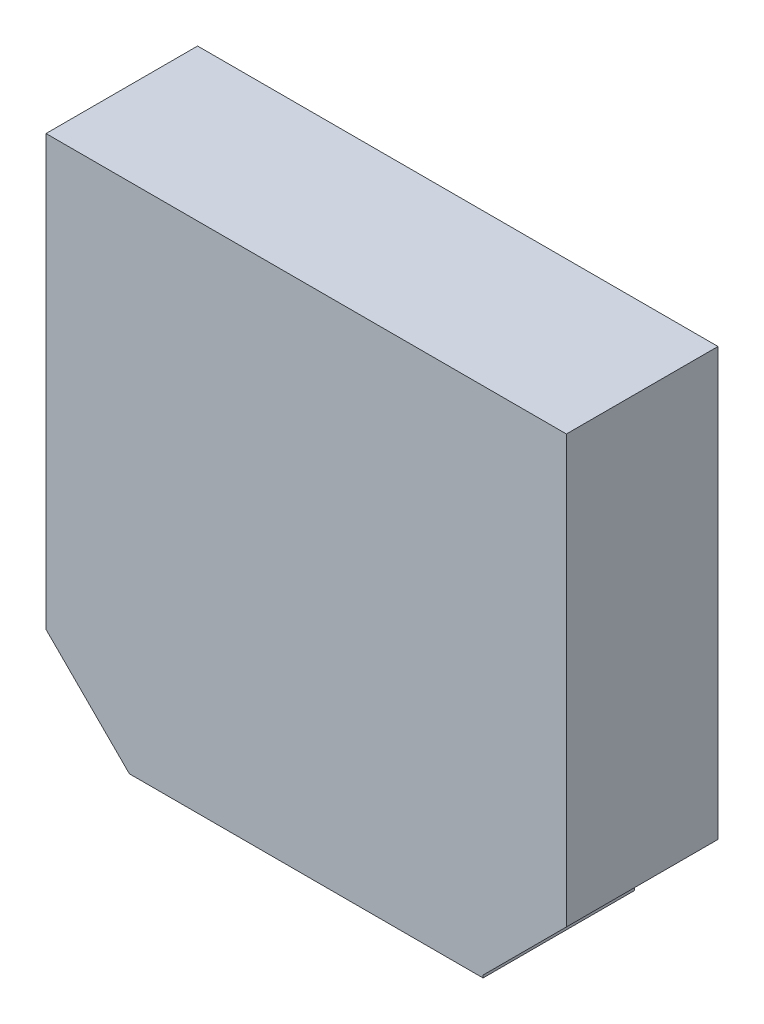
ISO-10303-21;
HEADER;
FILE_DESCRIPTION(('STEP AP214'),'2;1');
FILE_NAME('part.step','',(''),(''),'','','');
FILE_SCHEMA(('AUTOMOTIVE_DESIGN { 1 0 10303 214 1 1 1 1 }'));
ENDSEC;
DATA;
#1=APPLICATION_CONTEXT('core data for automotive mechanical design processes');
#2=APPLICATION_PROTOCOL_DEFINITION('international standard','automotive_design',2000,#1);
#3=PRODUCT_CONTEXT('',#1,'mechanical');
#4=PRODUCT('Part','Part','',(#3));
#5=PRODUCT_RELATED_PRODUCT_CATEGORY('part','',(#4));
#6=PRODUCT_DEFINITION_FORMATION('','',#4);
#7=PRODUCT_DEFINITION_CONTEXT('part definition',#1,'design');
#8=PRODUCT_DEFINITION('design','',#6,#7);
#9=PRODUCT_DEFINITION_SHAPE('','',#8);
#10=(LENGTH_UNIT() NAMED_UNIT(*) SI_UNIT(.MILLI.,.METRE.));
#11=(NAMED_UNIT(*) PLANE_ANGLE_UNIT() SI_UNIT($,.RADIAN.));
#12=(NAMED_UNIT(*) SI_UNIT($,.STERADIAN.) SOLID_ANGLE_UNIT());
#13=UNCERTAINTY_MEASURE_WITH_UNIT(LENGTH_MEASURE(1.E-05),#10,'distance_accuracy_value','');
#14=(GEOMETRIC_REPRESENTATION_CONTEXT(3) GLOBAL_UNCERTAINTY_ASSIGNED_CONTEXT((#13)) GLOBAL_UNIT_ASSIGNED_CONTEXT((#10,
#11,#12)) REPRESENTATION_CONTEXT('',''));
#15=CARTESIAN_POINT('',(0.,0.,0.));
#16=DIRECTION('',(0.,0.,1.));
#17=DIRECTION('',(1.,0.,0.));
#18=AXIS2_PLACEMENT_3D('',#15,#16,#17);
#19=CARTESIAN_POINT('',(3.50000062,-5.07499874,0.));
#20=DIRECTION('',(-1.,0.,0.));
#21=DIRECTION('',(0.,0.,1.));
#22=AXIS2_PLACEMENT_3D('',#19,#20,#21);
#23=PLANE('',#22);
#24=DIRECTION('',(0.,0.,1.));
#25=VECTOR('',#24,1.);
#26=CARTESIAN_POINT('',(3.50000062,-5.02499884,0.));
#27=LINE('',#26,#25);
#28=CARTESIAN_POINT('',(3.50000062,-5.02499884,0.));
#29=VERTEX_POINT('',#28);
#30=CARTESIAN_POINT('',(3.50000062,-5.02499884,2.99999908));
#31=VERTEX_POINT('',#30);
#32=EDGE_CURVE('E79',#29,#31,#27,.T.);
#33=ORIENTED_EDGE('',*,*,#32,.T.);
#34=DIRECTION('',(0.,1.,0.));
#35=VECTOR('',#34,1.);
#36=CARTESIAN_POINT('',(3.50000062,5.07500128,2.99999908));
#37=LINE('',#36,#35);
#38=CARTESIAN_POINT('',(3.50000062,-5.07499874,2.99999908));
#39=VERTEX_POINT('',#38);
#40=EDGE_CURVE('E81',#31,#39,#37,.F.);
#41=ORIENTED_EDGE('',*,*,#40,.T.);
#42=DIRECTION('',(0.,0.,1.));
#43=VECTOR('',#42,1.);
#44=CARTESIAN_POINT('',(3.50000062,-5.07499874,0.));
#45=LINE('',#44,#43);
#46=CARTESIAN_POINT('',(3.50000062,-5.07499874,0.));
#47=VERTEX_POINT('',#46);
#48=EDGE_CURVE('E123',#39,#47,#45,.F.);
#49=ORIENTED_EDGE('',*,*,#48,.T.);
#50=DIRECTION('',(0.,1.,0.));
#51=VECTOR('',#50,1.);
#52=CARTESIAN_POINT('',(3.50000062,-5.07499874,0.));
#53=LINE('',#52,#51);
#54=EDGE_CURVE('E20',#29,#47,#53,.F.);
#55=ORIENTED_EDGE('',*,*,#54,.F.);
#56=EDGE_LOOP('',(#33,#41,#49,#55));
#57=FACE_BOUND('',#56,.T.);
#58=ADVANCED_FACE('F17',(#57),#23,.F.);
#59=CARTESIAN_POINT('',(5.14999986,5.07500128,2.99999908));
#60=DIRECTION('',(0.,0.,-1.));
#61=DIRECTION('',(-1.,0.,0.));
#62=AXIS2_PLACEMENT_3D('',#59,#60,#61);
#63=PLANE('',#62);
#64=DIRECTION('',(0.,1.,0.));
#65=VECTOR('',#64,1.);
#66=CARTESIAN_POINT('',(-5.14999986,5.07500128,2.99999908));
#67=LINE('',#66,#65);
#68=CARTESIAN_POINT('',(-5.14999986,5.07500128,2.99999908));
#69=VERTEX_POINT('',#68);
#70=CARTESIAN_POINT('',(-5.14999986,-3.4249995,2.99999908));
#71=VERTEX_POINT('',#70);
#72=EDGE_CURVE('E117',#69,#71,#67,.F.);
#73=ORIENTED_EDGE('',*,*,#72,.T.);
#74=DIRECTION('',(-0.707106781186548,0.707106781186548,0.));
#75=VECTOR('',#74,1.);
#76=CARTESIAN_POINT('',(-5.14999986,-3.4249995,2.99999908));
#77=LINE('',#76,#75);
#78=CARTESIAN_POINT('',(-3.50000062,-5.07499874,2.99999908));
#79=VERTEX_POINT('',#78);
#80=EDGE_CURVE('E121',#71,#79,#77,.F.);
#81=ORIENTED_EDGE('',*,*,#80,.T.);
#82=DIRECTION('',(1.,0.,0.));
#83=VECTOR('',#82,1.);
#84=CARTESIAN_POINT('',(-3.50000062,-5.07499874,2.99999908));
#85=LINE('',#84,#83);
#86=EDGE_CURVE('E90',#79,#39,#85,.T.);
#87=ORIENTED_EDGE('',*,*,#86,.T.);
#88=ORIENTED_EDGE('',*,*,#40,.F.);
#89=DIRECTION('',(-0.707106781186548,-0.707106781186548,0.));
#90=VECTOR('',#89,1.);
#91=CARTESIAN_POINT('',(3.50000062,-5.02499884,2.99999908));
#92=LINE('',#91,#90);
#93=CARTESIAN_POINT('',(5.14999986,-3.3749996,2.99999908));
#94=VERTEX_POINT('',#93);
#95=EDGE_CURVE('E74',#31,#94,#92,.F.);
#96=ORIENTED_EDGE('',*,*,#95,.T.);
#97=DIRECTION('',(0.,1.,0.));
#98=VECTOR('',#97,1.);
#99=CARTESIAN_POINT('',(5.14999986,-3.3749996,2.99999908));
#100=LINE('',#99,#98);
#101=CARTESIAN_POINT('',(5.14999986,5.07500128,2.99999908));
#102=VERTEX_POINT('',#101);
#103=EDGE_CURVE('E86',#94,#102,#100,.T.);
#104=ORIENTED_EDGE('',*,*,#103,.T.);
#105=DIRECTION('',(1.,0.,0.));
#106=VECTOR('',#105,1.);
#107=CARTESIAN_POINT('',(5.14999986,5.07500128,2.99999908));
#108=LINE('',#107,#106);
#109=EDGE_CURVE('E101',#102,#69,#108,.F.);
#110=ORIENTED_EDGE('',*,*,#109,.T.);
#111=EDGE_LOOP('',(#73,#81,#87,#88,#96,#104,#110));
#112=FACE_BOUND('',#111,.T.);
#113=ADVANCED_FACE('F88',(#112),#63,.F.);
#114=CARTESIAN_POINT('',(5.14999986,-3.3749996,0.));
#115=DIRECTION('',(-1.,0.,0.));
#116=DIRECTION('',(0.,0.,1.));
#117=AXIS2_PLACEMENT_3D('',#114,#115,#116);
#118=PLANE('',#117);
#119=DIRECTION('',(0.,0.,-1.));
#120=VECTOR('',#119,1.);
#121=CARTESIAN_POINT('',(5.14999986,5.07500128,0.));
#122=LINE('',#121,#120);
#123=CARTESIAN_POINT('',(5.14999986,5.07500128,0.));
#124=VERTEX_POINT('',#123);
#125=EDGE_CURVE('E104',#124,#102,#122,.F.);
#126=ORIENTED_EDGE('',*,*,#125,.T.);
#127=ORIENTED_EDGE('',*,*,#103,.F.);
#128=DIRECTION('',(0.,0.,1.));
#129=VECTOR('',#128,1.);
#130=CARTESIAN_POINT('',(5.14999986,-3.3749996,0.));
#131=LINE('',#130,#129);
#132=CARTESIAN_POINT('',(5.14999986,-3.3749996,0.));
#133=VERTEX_POINT('',#132);
#134=EDGE_CURVE('E94',#94,#133,#131,.F.);
#135=ORIENTED_EDGE('',*,*,#134,.T.);
#136=DIRECTION('',(0.,1.,0.));
#137=VECTOR('',#136,1.);
#138=CARTESIAN_POINT('',(5.14999986,5.07500128,0.));
#139=LINE('',#138,#137);
#140=EDGE_CURVE('E107',#124,#133,#139,.F.);
#141=ORIENTED_EDGE('',*,*,#140,.F.);
#142=EDGE_LOOP('',(#126,#127,#135,#141));
#143=FACE_BOUND('',#142,.T.);
#144=ADVANCED_FACE('F105',(#143),#118,.F.);
#145=CARTESIAN_POINT('',(3.50000062,-5.02499884,0.));
#146=DIRECTION('',(-0.707106781186548,0.707106781186548,0.));
#147=DIRECTION('',(-0.707106781186548,-0.707106781186548,0.));
#148=AXIS2_PLACEMENT_3D('',#145,#146,#147);
#149=PLANE('',#148);
#150=ORIENTED_EDGE('',*,*,#134,.F.);
#151=ORIENTED_EDGE('',*,*,#95,.F.);
#152=ORIENTED_EDGE('',*,*,#32,.F.);
#153=DIRECTION('',(-0.707106781186548,-0.707106781186547,0.));
#154=VECTOR('',#153,1.);
#155=CARTESIAN_POINT('',(5.14999986,-3.3749996,0.));
#156=LINE('',#155,#154);
#157=EDGE_CURVE('E134',#133,#29,#156,.T.);
#158=ORIENTED_EDGE('',*,*,#157,.F.);
#159=EDGE_LOOP('',(#150,#151,#152,#158));
#160=FACE_BOUND('',#159,.T.);
#161=ADVANCED_FACE('F93',(#160),#149,.F.);
#162=CARTESIAN_POINT('',(-3.50000062,-5.07499874,0.));
#163=DIRECTION('',(0.,1.,0.));
#164=DIRECTION('',(0.,0.,1.));
#165=AXIS2_PLACEMENT_3D('',#162,#163,#164);
#166=PLANE('',#165);
#167=ORIENTED_EDGE('',*,*,#48,.F.);
#168=ORIENTED_EDGE('',*,*,#86,.F.);
#169=DIRECTION('',(0.,0.,1.));
#170=VECTOR('',#169,1.);
#171=CARTESIAN_POINT('',(-3.50000062,-5.07499874,0.));
#172=LINE('',#171,#170);
#173=CARTESIAN_POINT('',(-3.50000062,-5.07499874,0.));
#174=VERTEX_POINT('',#173);
#175=EDGE_CURVE('E119',#79,#174,#172,.F.);
#176=ORIENTED_EDGE('',*,*,#175,.T.);
#177=DIRECTION('',(-1.,0.,0.));
#178=VECTOR('',#177,1.);
#179=CARTESIAN_POINT('',(5.14999986,-5.07499874,0.));
#180=LINE('',#179,#178);
#181=EDGE_CURVE('E127',#47,#174,#180,.T.);
#182=ORIENTED_EDGE('',*,*,#181,.F.);
#183=EDGE_LOOP('',(#167,#168,#176,#182));
#184=FACE_BOUND('',#183,.T.);
#185=ADVANCED_FACE('F128',(#184),#166,.F.);
#186=CARTESIAN_POINT('',(-5.14999986,-3.4249995,0.));
#187=DIRECTION('',(0.707106781186548,0.707106781186548,0.));
#188=DIRECTION('',(-0.707106781186548,0.707106781186548,0.));
#189=AXIS2_PLACEMENT_3D('',#186,#187,#188);
#190=PLANE('',#189);
#191=ORIENTED_EDGE('',*,*,#175,.F.);
#192=ORIENTED_EDGE('',*,*,#80,.F.);
#193=DIRECTION('',(0.,0.,-1.));
#194=VECTOR('',#193,1.);
#195=CARTESIAN_POINT('',(-5.14999986,-3.4249995,0.));
#196=LINE('',#195,#194);
#197=CARTESIAN_POINT('',(-5.14999986,-3.4249995,0.));
#198=VERTEX_POINT('',#197);
#199=EDGE_CURVE('E109',#71,#198,#196,.T.);
#200=ORIENTED_EDGE('',*,*,#199,.T.);
#201=DIRECTION('',(-0.707106781186548,0.707106781186547,0.));
#202=VECTOR('',#201,1.);
#203=CARTESIAN_POINT('',(-3.50000062,-5.07499874,0.));
#204=LINE('',#203,#202);
#205=EDGE_CURVE('E133',#174,#198,#204,.T.);
#206=ORIENTED_EDGE('',*,*,#205,.F.);
#207=EDGE_LOOP('',(#191,#192,#200,#206));
#208=FACE_BOUND('',#207,.T.);
#209=ADVANCED_FACE('F145',(#208),#190,.F.);
#210=CARTESIAN_POINT('',(-5.14999986,5.07500128,0.));
#211=DIRECTION('',(1.,0.,0.));
#212=DIRECTION('',(0.,0.,-1.));
#213=AXIS2_PLACEMENT_3D('',#210,#211,#212);
#214=PLANE('',#213);
#215=ORIENTED_EDGE('',*,*,#199,.F.);
#216=ORIENTED_EDGE('',*,*,#72,.F.);
#217=DIRECTION('',(0.,0.,-1.));
#218=VECTOR('',#217,1.);
#219=CARTESIAN_POINT('',(-5.14999986,5.07500128,0.));
#220=LINE('',#219,#218);
#221=CARTESIAN_POINT('',(-5.14999986,5.07500128,0.));
#222=VERTEX_POINT('',#221);
#223=EDGE_CURVE('E35',#69,#222,#220,.T.);
#224=ORIENTED_EDGE('',*,*,#223,.T.);
#225=DIRECTION('',(0.,1.,0.));
#226=VECTOR('',#225,1.);
#227=CARTESIAN_POINT('',(-5.14999986,5.07500128,0.));
#228=LINE('',#227,#226);
#229=EDGE_CURVE('E26',#198,#222,#228,.T.);
#230=ORIENTED_EDGE('',*,*,#229,.F.);
#231=EDGE_LOOP('',(#215,#216,#224,#230));
#232=FACE_BOUND('',#231,.T.);
#233=ADVANCED_FACE('F142',(#232),#214,.F.);
#234=CARTESIAN_POINT('',(5.14999986,5.07500128,0.));
#235=DIRECTION('',(0.,-1.,0.));
#236=DIRECTION('',(0.,0.,-1.));
#237=AXIS2_PLACEMENT_3D('',#234,#235,#236);
#238=PLANE('',#237);
#239=ORIENTED_EDGE('',*,*,#223,.F.);
#240=ORIENTED_EDGE('',*,*,#109,.F.);
#241=ORIENTED_EDGE('',*,*,#125,.F.);
#242=DIRECTION('',(-1.,0.,0.));
#243=VECTOR('',#242,1.);
#244=CARTESIAN_POINT('',(5.14999986,5.07500128,0.));
#245=LINE('',#244,#243);
#246=EDGE_CURVE('E11',#222,#124,#245,.F.);
#247=ORIENTED_EDGE('',*,*,#246,.F.);
#248=EDGE_LOOP('',(#239,#240,#241,#247));
#249=FACE_BOUND('',#248,.T.);
#250=ADVANCED_FACE('F111',(#249),#238,.F.);
#251=CARTESIAN_POINT('',(5.14999986,5.07500128,0.));
#252=DIRECTION('',(0.,0.,-1.));
#253=DIRECTION('',(-1.,0.,0.));
#254=AXIS2_PLACEMENT_3D('',#251,#252,#253);
#255=PLANE('',#254);
#256=ORIENTED_EDGE('',*,*,#229,.T.);
#257=ORIENTED_EDGE('',*,*,#246,.T.);
#258=ORIENTED_EDGE('',*,*,#140,.T.);
#259=ORIENTED_EDGE('',*,*,#157,.T.);
#260=ORIENTED_EDGE('',*,*,#54,.T.);
#261=ORIENTED_EDGE('',*,*,#181,.T.);
#262=ORIENTED_EDGE('',*,*,#205,.T.);
#263=EDGE_LOOP('',(#256,#257,#258,#259,#260,#261,#262));
#264=FACE_BOUND('',#263,.T.);
#265=ADVANCED_FACE('F140',(#264),#255,.T.);
#266=CLOSED_SHELL('',(#58,#113,#144,#161,#185,#209,#233,#250,#265));
#267=MANIFOLD_SOLID_BREP('B1',#266);
#268=ADVANCED_BREP_SHAPE_REPRESENTATION('',(#18,#267),#14);
#269=SHAPE_DEFINITION_REPRESENTATION(#9,#268);
ENDSEC;
END-ISO-10303-21;
